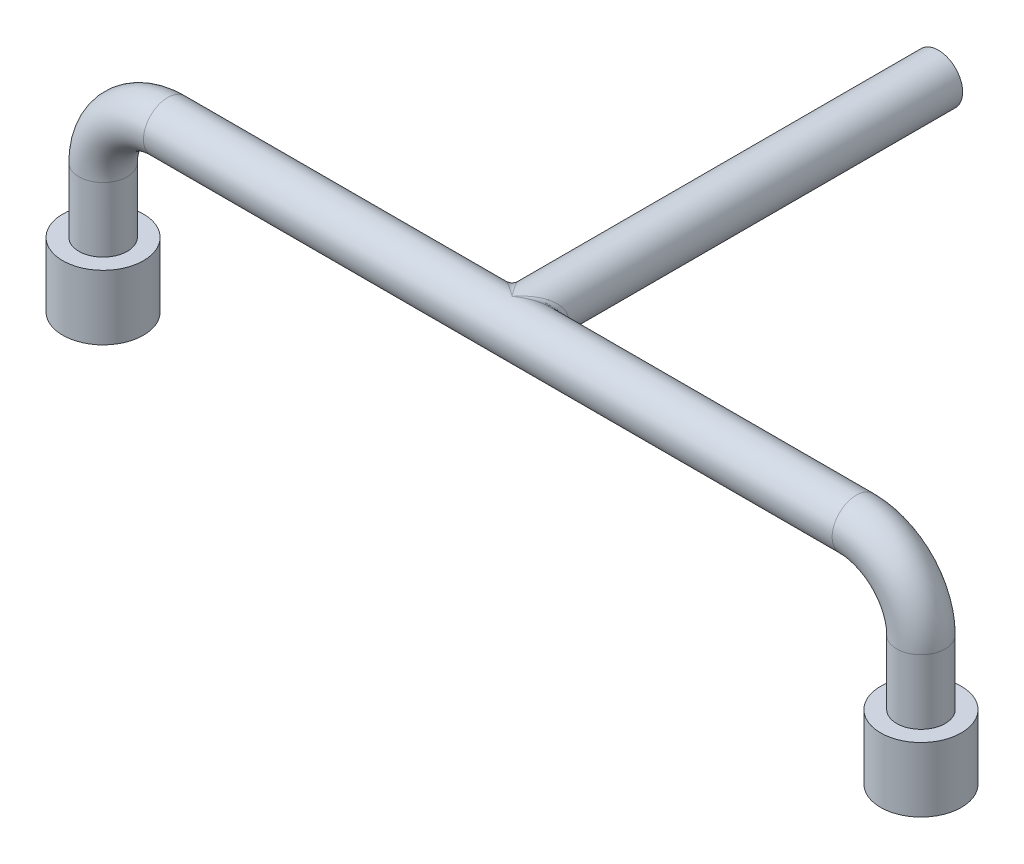
ISO-10303-21;
HEADER;
FILE_DESCRIPTION(('STEP AP214'),'2;1');
FILE_NAME('part.step','',(''),(''),'','','');
FILE_SCHEMA(('AUTOMOTIVE_DESIGN { 1 0 10303 214 1 1 1 1 }'));
ENDSEC;
DATA;
#1=APPLICATION_CONTEXT('core data for automotive mechanical design processes');
#2=APPLICATION_PROTOCOL_DEFINITION('international standard','automotive_design',2000,#1);
#3=PRODUCT_CONTEXT('',#1,'mechanical');
#4=PRODUCT('Part','Part','',(#3));
#5=PRODUCT_RELATED_PRODUCT_CATEGORY('part','',(#4));
#6=PRODUCT_DEFINITION_FORMATION('','',#4);
#7=PRODUCT_DEFINITION_CONTEXT('part definition',#1,'design');
#8=PRODUCT_DEFINITION('design','',#6,#7);
#9=PRODUCT_DEFINITION_SHAPE('','',#8);
#10=(LENGTH_UNIT() NAMED_UNIT(*) SI_UNIT(.MILLI.,.METRE.));
#11=(NAMED_UNIT(*) PLANE_ANGLE_UNIT() SI_UNIT($,.RADIAN.));
#12=(NAMED_UNIT(*) SI_UNIT($,.STERADIAN.) SOLID_ANGLE_UNIT());
#13=UNCERTAINTY_MEASURE_WITH_UNIT(LENGTH_MEASURE(1.E-05),#10,'distance_accuracy_value','');
#14=(GEOMETRIC_REPRESENTATION_CONTEXT(3) GLOBAL_UNCERTAINTY_ASSIGNED_CONTEXT((#13)) GLOBAL_UNIT_ASSIGNED_CONTEXT((#10,
#11,#12)) REPRESENTATION_CONTEXT('',''));
#15=CARTESIAN_POINT('',(0.,0.,0.));
#16=DIRECTION('',(0.,0.,1.));
#17=DIRECTION('',(1.,0.,0.));
#18=AXIS2_PLACEMENT_3D('',#15,#16,#17);
#19=CARTESIAN_POINT('',(80.391,12.7,0.));
#20=DIRECTION('',(0.,-1.,0.));
#21=DIRECTION('',(0.,0.,-1.));
#22=AXIS2_PLACEMENT_3D('',#19,#20,#21);
#23=CYLINDRICAL_SURFACE('',#22,4.7625);
#24=CARTESIAN_POINT('',(80.391,12.7,0.));
#25=DIRECTION('',(0.,-1.,0.));
#26=DIRECTION('',(0.,0.,1.));
#27=AXIS2_PLACEMENT_3D('',#24,#25,#26);
#28=CIRCLE('',#27,4.7625);
#29=CARTESIAN_POINT('',(85.1535,12.7,0.));
#30=VERTEX_POINT('',#29);
#31=EDGE_CURVE('E83',#30,#30,#28,.T.);
#32=ORIENTED_EDGE('',*,*,#31,.T.);
#33=EDGE_LOOP('',(#32));
#34=FACE_BOUND('',#33,.T.);
#35=CARTESIAN_POINT('',(80.391,0.,0.));
#36=DIRECTION('',(0.,-1.,0.));
#37=DIRECTION('',(0.,0.,1.));
#38=AXIS2_PLACEMENT_3D('',#35,#36,#37);
#39=CIRCLE('',#38,4.7625);
#40=CARTESIAN_POINT('',(80.391,0.,4.7625));
#41=VERTEX_POINT('',#40);
#42=EDGE_CURVE('E80',#41,#41,#39,.T.);
#43=ORIENTED_EDGE('',*,*,#42,.F.);
#44=EDGE_LOOP('',(#43));
#45=FACE_BOUND('',#44,.T.);
#46=ADVANCED_FACE('F45',(#34,#45),#23,.T.);
#47=CARTESIAN_POINT('',(67.691,12.7,0.));
#48=DIRECTION('',(0.,0.,-1.));
#49=DIRECTION('',(-1.,0.,0.));
#50=AXIS2_PLACEMENT_3D('',#47,#48,#49);
#51=TOROIDAL_SURFACE('',#50,12.7,4.7625);
#52=CARTESIAN_POINT('',(67.691,25.4,0.));
#53=DIRECTION('',(1.,0.,0.));
#54=DIRECTION('',(0.,0.,1.));
#55=AXIS2_PLACEMENT_3D('',#52,#53,#54);
#56=CIRCLE('',#55,4.7625);
#57=CARTESIAN_POINT('',(67.691,30.1625,0.));
#58=VERTEX_POINT('',#57);
#59=EDGE_CURVE('E113',#58,#58,#56,.T.);
#60=CARTESIAN_POINT('',(67.691,12.7,0.));
#61=DIRECTION('',(0.,0.,-1.));
#62=DIRECTION('',(-1.,0.,0.));
#63=AXIS2_PLACEMENT_3D('',#60,#61,#62);
#64=CIRCLE('',#63,17.4625);
#65=EDGE_CURVE('',#58,#30,#64,.T.);
#66=ORIENTED_EDGE('',*,*,#59,.T.);
#67=ORIENTED_EDGE('',*,*,#31,.F.);
#68=ORIENTED_EDGE('',*,*,#65,.T.);
#69=ORIENTED_EDGE('',*,*,#65,.F.);
#70=EDGE_LOOP('',(#66,#68,#67,#69));
#71=FACE_BOUND('',#70,.T.);
#72=ADVANCED_FACE('F100',(#71),#51,.T.);
#73=CARTESIAN_POINT('',(-67.691,25.4,0.));
#74=DIRECTION('',(1.,0.,0.));
#75=DIRECTION('',(0.,1.,0.));
#76=AXIS2_PLACEMENT_3D('',#73,#74,#75);
#77=CYLINDRICAL_SURFACE('',#76,4.7625);
#78=CARTESIAN_POINT('',(0.,25.4,0.));
#79=DIRECTION('',(-0.6,0.,-0.8));
#80=DIRECTION('',(-0.8,0.,0.6));
#81=AXIS2_PLACEMENT_3D('',#78,#79,#80);
#82=ELLIPSE('',#81,7.93749999999999,4.76249999999999);
#83=CARTESIAN_POINT('',(0.,20.6375,0.));
#84=VERTEX_POINT('',#83);
#85=CARTESIAN_POINT('',(0.,30.1625,0.));
#86=VERTEX_POINT('',#85);
#87=EDGE_CURVE('E58',#84,#86,#82,.F.);
#88=ORIENTED_EDGE('',*,*,#87,.T.);
#89=CARTESIAN_POINT('',(0.,25.4,0.));
#90=DIRECTION('',(0.6,0.,-0.8));
#91=DIRECTION('',(0.8,0.,0.6));
#92=AXIS2_PLACEMENT_3D('',#89,#90,#91);
#93=ELLIPSE('',#92,7.93749999999999,4.76249999999999);
#94=EDGE_CURVE('E11',#86,#84,#93,.F.);
#95=ORIENTED_EDGE('',*,*,#94,.T.);
#96=EDGE_LOOP('',(#88,#95));
#97=FACE_BOUND('',#96,.T.);
#98=CARTESIAN_POINT('',(-67.691,25.4,0.));
#99=DIRECTION('',(1.,0.,0.));
#100=DIRECTION('',(0.,0.,1.));
#101=AXIS2_PLACEMENT_3D('',#98,#99,#100);
#102=CIRCLE('',#101,4.7625);
#103=CARTESIAN_POINT('',(-67.691,30.1625,0.));
#104=VERTEX_POINT('',#103);
#105=EDGE_CURVE('E116',#104,#104,#102,.T.);
#106=ORIENTED_EDGE('',*,*,#105,.T.);
#107=EDGE_LOOP('',(#106));
#108=FACE_BOUND('',#107,.T.);
#109=ORIENTED_EDGE('',*,*,#59,.F.);
#110=EDGE_LOOP('',(#109));
#111=FACE_BOUND('',#110,.T.);
#112=ADVANCED_FACE('F73',(#97,#108,#111),#77,.T.);
#113=CARTESIAN_POINT('',(-67.691,12.7,0.));
#114=DIRECTION('',(0.,0.,-1.));
#115=DIRECTION('',(-1.,0.,0.));
#116=AXIS2_PLACEMENT_3D('',#113,#114,#115);
#117=TOROIDAL_SURFACE('',#116,12.7,4.7625);
#118=CARTESIAN_POINT('',(-80.391,12.7,0.));
#119=DIRECTION('',(0.,1.,0.));
#120=DIRECTION('',(0.,0.,1.));
#121=AXIS2_PLACEMENT_3D('',#118,#119,#120);
#122=CIRCLE('',#121,4.7625);
#123=CARTESIAN_POINT('',(-85.1535,12.7,0.));
#124=VERTEX_POINT('',#123);
#125=EDGE_CURVE('E121',#124,#124,#122,.T.);
#126=CARTESIAN_POINT('',(-67.691,12.7,0.));
#127=DIRECTION('',(0.,0.,-1.));
#128=DIRECTION('',(-1.,0.,0.));
#129=AXIS2_PLACEMENT_3D('',#126,#127,#128);
#130=CIRCLE('',#129,17.4625);
#131=EDGE_CURVE('',#124,#104,#130,.T.);
#132=ORIENTED_EDGE('',*,*,#125,.T.);
#133=ORIENTED_EDGE('',*,*,#105,.F.);
#134=ORIENTED_EDGE('',*,*,#131,.T.);
#135=ORIENTED_EDGE('',*,*,#131,.F.);
#136=EDGE_LOOP('',(#132,#134,#133,#135));
#137=FACE_BOUND('',#136,.T.);
#138=ADVANCED_FACE('F99',(#137),#117,.T.);
#139=CARTESIAN_POINT('',(-80.391,12.7,0.));
#140=DIRECTION('',(0.,-1.,0.));
#141=DIRECTION('',(0.,0.,-1.));
#142=AXIS2_PLACEMENT_3D('',#139,#140,#141);
#143=CYLINDRICAL_SURFACE('',#142,4.7625);
#144=ORIENTED_EDGE('',*,*,#125,.F.);
#145=EDGE_LOOP('',(#144));
#146=FACE_BOUND('',#145,.T.);
#147=CARTESIAN_POINT('',(-80.391,0.,0.));
#148=DIRECTION('',(0.,-1.,0.));
#149=DIRECTION('',(0.,0.,-1.));
#150=AXIS2_PLACEMENT_3D('',#147,#148,#149);
#151=CIRCLE('',#150,4.7625);
#152=CARTESIAN_POINT('',(-80.391,0.,-4.7625));
#153=VERTEX_POINT('',#152);
#154=EDGE_CURVE('E124',#153,#153,#151,.T.);
#155=ORIENTED_EDGE('',*,*,#154,.F.);
#156=EDGE_LOOP('',(#155));
#157=FACE_BOUND('',#156,.T.);
#158=ADVANCED_FACE('F173',(#146,#157),#143,.T.);
#159=CARTESIAN_POINT('',(-80.391,0.,0.));
#160=DIRECTION('',(0.,-1.,0.));
#161=DIRECTION('',(0.,0.,-1.));
#162=AXIS2_PLACEMENT_3D('',#159,#160,#161);
#163=PLANE('',#162);
#164=CARTESIAN_POINT('',(-80.391,0.,0.));
#165=DIRECTION('',(0.,-1.,0.));
#166=DIRECTION('',(0.,0.,-1.));
#167=AXIS2_PLACEMENT_3D('',#164,#165,#166);
#168=CIRCLE('',#167,7.93749999999999);
#169=CARTESIAN_POINT('',(-80.391,0.,-7.93749999999999));
#170=VERTEX_POINT('',#169);
#171=EDGE_CURVE('E128',#170,#170,#168,.T.);
#172=ORIENTED_EDGE('',*,*,#171,.F.);
#173=EDGE_LOOP('',(#172));
#174=FACE_BOUND('',#173,.T.);
#175=ORIENTED_EDGE('',*,*,#154,.T.);
#176=EDGE_LOOP('',(#175));
#177=FACE_BOUND('',#176,.T.);
#178=ADVANCED_FACE('F170',(#174,#177),#163,.F.);
#179=CARTESIAN_POINT('',(-80.391,-12.7,0.));
#180=DIRECTION('',(0.,1.,0.));
#181=DIRECTION('',(0.,0.,1.));
#182=AXIS2_PLACEMENT_3D('',#179,#180,#181);
#183=CYLINDRICAL_SURFACE('',#182,7.93749999999999);
#184=CARTESIAN_POINT('',(-80.391,-12.7,0.));
#185=DIRECTION('',(0.,-1.,0.));
#186=DIRECTION('',(0.,0.,-1.));
#187=AXIS2_PLACEMENT_3D('',#184,#185,#186);
#188=CIRCLE('',#187,7.93749999999999);
#189=CARTESIAN_POINT('',(-80.391,-12.7,-7.93749999999999));
#190=VERTEX_POINT('',#189);
#191=EDGE_CURVE('E127',#190,#190,#188,.T.);
#192=ORIENTED_EDGE('',*,*,#191,.F.);
#193=EDGE_LOOP('',(#192));
#194=FACE_BOUND('',#193,.T.);
#195=ORIENTED_EDGE('',*,*,#171,.T.);
#196=EDGE_LOOP('',(#195));
#197=FACE_BOUND('',#196,.T.);
#198=ADVANCED_FACE('F168',(#194,#197),#183,.T.);
#199=CARTESIAN_POINT('',(-80.391,-12.7,0.));
#200=DIRECTION('',(0.,-1.,0.));
#201=DIRECTION('',(0.,0.,-1.));
#202=AXIS2_PLACEMENT_3D('',#199,#200,#201);
#203=PLANE('',#202);
#204=ORIENTED_EDGE('',*,*,#191,.T.);
#205=EDGE_LOOP('',(#204));
#206=FACE_BOUND('',#205,.T.);
#207=ADVANCED_FACE('F164',(#206),#203,.T.);
#208=CARTESIAN_POINT('',(80.391,-12.6999999999387,0.));
#209=DIRECTION('',(0.,1.,0.));
#210=DIRECTION('',(-1.,0.,0.));
#211=AXIS2_PLACEMENT_3D('',#208,#209,#210);
#212=CYLINDRICAL_SURFACE('',#211,7.93750000000001);
#213=CARTESIAN_POINT('',(80.391,-12.6999999999387,0.));
#214=DIRECTION('',(0.,-1.,0.));
#215=DIRECTION('',(1.,0.,0.));
#216=AXIS2_PLACEMENT_3D('',#213,#214,#215);
#217=CIRCLE('',#216,7.93750000000001);
#218=CARTESIAN_POINT('',(88.3285,-12.6999999999387,0.));
#219=VERTEX_POINT('',#218);
#220=EDGE_CURVE('E131',#219,#219,#217,.T.);
#221=ORIENTED_EDGE('',*,*,#220,.F.);
#222=EDGE_LOOP('',(#221));
#223=FACE_BOUND('',#222,.T.);
#224=CARTESIAN_POINT('',(80.391,6.12637972810166E-11,0.));
#225=DIRECTION('',(0.,-1.,0.));
#226=DIRECTION('',(1.,0.,0.));
#227=AXIS2_PLACEMENT_3D('',#224,#225,#226);
#228=CIRCLE('',#227,7.93750000000001);
#229=CARTESIAN_POINT('',(88.3285,6.12647693123099E-11,0.));
#230=VERTEX_POINT('',#229);
#231=EDGE_CURVE('E134',#230,#230,#228,.T.);
#232=ORIENTED_EDGE('',*,*,#231,.T.);
#233=EDGE_LOOP('',(#232));
#234=FACE_BOUND('',#233,.T.);
#235=ADVANCED_FACE('F158',(#223,#234),#212,.T.);
#236=CARTESIAN_POINT('',(80.391,-12.6999999999387,0.));
#237=DIRECTION('',(0.,-1.,0.));
#238=DIRECTION('',(1.,0.,0.));
#239=AXIS2_PLACEMENT_3D('',#236,#237,#238);
#240=PLANE('',#239);
#241=ORIENTED_EDGE('',*,*,#220,.T.);
#242=EDGE_LOOP('',(#241));
#243=FACE_BOUND('',#242,.T.);
#244=ADVANCED_FACE('F152',(#243),#240,.T.);
#245=CARTESIAN_POINT('',(80.391,6.12637972810166E-11,0.));
#246=DIRECTION('',(0.,-1.,0.));
#247=DIRECTION('',(1.,0.,0.));
#248=AXIS2_PLACEMENT_3D('',#245,#246,#247);
#249=PLANE('',#248);
#250=ORIENTED_EDGE('',*,*,#42,.T.);
#251=EDGE_LOOP('',(#250));
#252=FACE_BOUND('',#251,.T.);
#253=ORIENTED_EDGE('',*,*,#231,.F.);
#254=EDGE_LOOP('',(#253));
#255=FACE_BOUND('',#254,.T.);
#256=ADVANCED_FACE('F149',(#252,#255),#249,.F.);
#257=CARTESIAN_POINT('',(0.,25.4,-83.82));
#258=DIRECTION('',(0.,0.,1.));
#259=DIRECTION('',(1.,0.,0.));
#260=AXIS2_PLACEMENT_3D('',#257,#258,#259);
#261=CYLINDRICAL_SURFACE('',#260,4.76249999999999);
#262=CARTESIAN_POINT('',(0.,25.4,-83.82));
#263=DIRECTION('',(0.,0.,1.));
#264=DIRECTION('',(1.,0.,0.));
#265=AXIS2_PLACEMENT_3D('',#262,#263,#264);
#266=CIRCLE('',#265,4.76249999999999);
#267=CARTESIAN_POINT('',(4.76249999999999,25.4,-83.82));
#268=VERTEX_POINT('',#267);
#269=EDGE_CURVE('E137',#268,#268,#266,.T.);
#270=ORIENTED_EDGE('',*,*,#269,.T.);
#271=EDGE_LOOP('',(#270));
#272=FACE_BOUND('',#271,.T.);
#273=CARTESIAN_POINT('',(0.,25.4,0.));
#274=DIRECTION('',(-0.8,0.,-0.599999999999999));
#275=DIRECTION('',(-0.6,0.,0.8));
#276=AXIS2_PLACEMENT_3D('',#273,#274,#275);
#277=ELLIPSE('',#276,7.93749999999999,4.76249999999999);
#278=EDGE_CURVE('E78',#86,#84,#277,.T.);
#279=ORIENTED_EDGE('',*,*,#278,.T.);
#280=CARTESIAN_POINT('',(0.,25.4,0.));
#281=DIRECTION('',(0.8,0.,-0.599999999999999));
#282=DIRECTION('',(0.6,0.,0.8));
#283=AXIS2_PLACEMENT_3D('',#280,#281,#282);
#284=ELLIPSE('',#283,7.93749999999999,4.76249999999999);
#285=EDGE_CURVE('E70',#84,#86,#284,.T.);
#286=ORIENTED_EDGE('',*,*,#285,.T.);
#287=EDGE_LOOP('',(#279,#286));
#288=FACE_BOUND('',#287,.T.);
#289=ADVANCED_FACE('F77',(#272,#288),#261,.T.);
#290=CARTESIAN_POINT('',(0.,25.4,-83.82));
#291=DIRECTION('',(0.,0.,1.));
#292=DIRECTION('',(1.,0.,0.));
#293=AXIS2_PLACEMENT_3D('',#290,#291,#292);
#294=PLANE('',#293);
#295=ORIENTED_EDGE('',*,*,#269,.F.);
#296=EDGE_LOOP('',(#295));
#297=FACE_BOUND('',#296,.T.);
#298=ADVANCED_FACE('F91',(#297),#294,.F.);
#299=CARTESIAN_POINT('',(0.,30.1625,0.));
#300=CARTESIAN_POINT('',(0.,30.1625,0.));
#301=CARTESIAN_POINT('',(0.,30.1625,0.));
#302=CARTESIAN_POINT('',(-0.276636144109102,30.1624165246859,-0.207477108081827));
#303=CARTESIAN_POINT('',(-0.242104847775386,30.1628138962065,-0.242104847775386));
#304=CARTESIAN_POINT('',(-0.207477108081826,30.1624165246859,-0.276636144109102));
#305=CARTESIAN_POINT('',(-0.553342922971761,30.1489352393053,-0.415007192228821));
#306=CARTESIAN_POINT('',(-0.484875982339502,30.1444046693051,-0.484875982339502));
#307=CARTESIAN_POINT('',(-0.415007192228821,30.1489352393053,-0.553342922971761));
#308=CARTESIAN_POINT('',(-1.10199801149477,30.0948080845946,-0.826498508621077));
#309=CARTESIAN_POINT('',(-0.963135467760903,30.0721650554374,-0.963135467760904));
#310=CARTESIAN_POINT('',(-0.826498508621076,30.0948080845945,-1.10199801149477));
#311=CARTESIAN_POINT('',(-1.3739667760727,30.0543940853024,-1.03047508205453));
#312=CARTESIAN_POINT('',(-1.19999714632442,30.0182310228095,-1.19999714632442));
#313=CARTESIAN_POINT('',(-1.03047508205452,30.0543940853024,-1.3739667760727));
#314=CARTESIAN_POINT('',(-1.90851421254349,29.9469580402503,-1.43138565940762));
#315=CARTESIAN_POINT('',(-1.66059092050676,29.876334492538,-1.66059092050676));
#316=CARTESIAN_POINT('',(-1.43138565940762,29.9469580402503,-1.90851421254349));
#317=CARTESIAN_POINT('',(-2.17117387051649,29.8803936597922,-1.62838040288737));
#318=CARTESIAN_POINT('',(-1.88567913936315,29.7881682137678,-1.88567913936315));
#319=CARTESIAN_POINT('',(-1.62838040288737,29.8803936597922,-2.17117387051649));
#320=CARTESIAN_POINT('',(-2.68252871536545,29.7215399209432,-2.01189653652408));
#321=CARTESIAN_POINT('',(-2.31709780368268,29.5808891428275,-2.31709780368268));
#322=CARTESIAN_POINT('',(-2.01189653652408,29.7215399209432,-2.68252871536545));
#323=CARTESIAN_POINT('',(-2.93140851262626,29.629924676609,-2.19855638446969));
#324=CARTESIAN_POINT('',(-2.52473958108579,29.4614763748376,-2.52473958108579));
#325=CARTESIAN_POINT('',(-2.19855638446969,29.6299246766089,-2.93140851262626));
#326=CARTESIAN_POINT('',(-3.41083795440868,29.4223246880695,-2.55812846580651));
#327=CARTESIAN_POINT('',(-2.91600898929598,29.1960416589958,-2.91600898929598));
#328=CARTESIAN_POINT('',(-2.55812846580651,29.4223246880695,-3.41083795440868));
#329=CARTESIAN_POINT('',(-3.64171889556167,29.3072084469033,-2.73128917167126));
#330=CARTESIAN_POINT('',(-3.1008675301886,29.0496426920417,-3.1008675301886));
#331=CARTESIAN_POINT('',(-2.73128917167125,29.3072084469033,-3.64171889556167));
#332=CARTESIAN_POINT('',(-4.08104388669873,29.0543780859064,-3.06078291502405));
#333=CARTESIAN_POINT('',(-3.44199674373743,28.7361739863697,-3.44199674373743));
#334=CARTESIAN_POINT('',(-3.06078291502404,29.0543780859064,-4.08104388669873));
#335=CARTESIAN_POINT('',(-4.29000711482278,28.9176887105228,-3.21750533611709));
#336=CARTESIAN_POINT('',(-3.59936672350584,28.5686920739252,-3.59936672350584));
#337=CARTESIAN_POINT('',(-3.21750533611708,28.9176887105228,-4.29000711482278));
#338=CARTESIAN_POINT('',(-4.68172342974915,28.6238976459748,-3.51129257231186));
#339=CARTESIAN_POINT('',(-3.8821353406164,28.2206619503325,-3.8821353406164));
#340=CARTESIAN_POINT('',(-3.51129257231186,28.6238976459748,-4.68172342974915));
#341=CARTESIAN_POINT('',(-4.86521386828273,28.4679136477452,-3.64891040121205));
#342=CARTESIAN_POINT('',(-4.00844160972768,28.039744468855,-4.00844160972768));
#343=CARTESIAN_POINT('',(-3.64891040121205,28.4679136477452,-4.86521386828273));
#344=CARTESIAN_POINT('',(-5.20261642565318,28.1381211310113,-3.90196231923989));
#345=CARTESIAN_POINT('',(-4.22765661795512,27.6738976759814,-4.22765661795512));
#346=CARTESIAN_POINT('',(-3.90196231923988,28.1381211310113,-5.20261642565318));
#347=CARTESIAN_POINT('',(-5.35748732158705,27.9654289287181,-4.01811549119029));
#348=CARTESIAN_POINT('',(-4.32122640331491,27.488762399381,-4.32122640331491));
#349=CARTESIAN_POINT('',(-4.01811549119029,27.9654289287181,-5.35748732158705));
#350=CARTESIAN_POINT('',(-5.63477398209998,27.6052051725787,-4.22608048657499));
#351=CARTESIAN_POINT('',(-4.47643359152566,27.1239596449436,-4.47643359152566));
#352=CARTESIAN_POINT('',(-4.22608048657499,27.6052051725787,-5.63477398209998));
#353=CARTESIAN_POINT('',(-5.75832102813724,27.4186658166692,-4.31874077110293));
#354=CARTESIAN_POINT('',(-4.53846005821155,26.9444006382712,-4.53846005821155));
#355=CARTESIAN_POINT('',(-4.31874077110292,27.4186658166692,-5.75832102813724));
#356=CARTESIAN_POINT('',(-5.9706844248482,27.0341162705327,-4.47801331863615));
#357=CARTESIAN_POINT('',(-4.63555117722643,26.5983399156441,-4.63555117722643));
#358=CARTESIAN_POINT('',(-4.47801331863614,27.0341162705327,-5.9706844248482));
#359=CARTESIAN_POINT('',(-6.06067669184656,26.8368468919352,-4.54550751888492));
#360=CARTESIAN_POINT('',(-4.6707623658728,26.4323987364077,-4.6707623658728));
#361=CARTESIAN_POINT('',(-4.54550751888492,26.8368468919352,-6.06067669184656));
#362=CARTESIAN_POINT('',(-6.20439080078656,26.4345365569956,-4.65329310058992));
#363=CARTESIAN_POINT('',(-4.72196488162732,26.1158674475182,-4.72196488162732));
#364=CARTESIAN_POINT('',(-4.65329310058992,26.4345365569956,-6.20439080078656));
#365=CARTESIAN_POINT('',(-6.25912057996809,26.2299068098607,-4.69434043497607));
#366=CARTESIAN_POINT('',(-4.7379497748783,25.9663400491661,-4.7379497748783));
#367=CARTESIAN_POINT('',(-4.69434043497606,26.2299068098607,-6.25912057996809));
#368=CARTESIAN_POINT('',(-6.3316294277291,25.8167722698911,-4.74872207079683));
#369=CARTESIAN_POINT('',(-4.75823917623773,25.6771687936645,-4.75823917623773));
#370=CARTESIAN_POINT('',(-4.74872207079682,25.8167722698911,-6.3316294277291));
#371=CARTESIAN_POINT('',(-6.34999999999999,25.6083861349455,-4.7625));
#372=CARTESIAN_POINT('',(-4.76249999999999,25.5389887993662,-4.76249999999999));
#373=CARTESIAN_POINT('',(-4.76249999999999,25.6083861349455,-6.34999999999999));
#374=CARTESIAN_POINT('',(-6.34999999999999,25.1916138650545,-4.7625));
#375=CARTESIAN_POINT('',(-4.76249999999999,25.2610112006338,-4.76249999999999));
#376=CARTESIAN_POINT('',(-4.76249999999999,25.1916138650545,-6.34999999999999));
#377=CARTESIAN_POINT('',(-6.3316294277291,24.9832277301089,-4.74872207079683));
#378=CARTESIAN_POINT('',(-4.75823917623773,25.1228312063355,-4.75823917623773));
#379=CARTESIAN_POINT('',(-4.74872207079682,24.9832277301089,-6.3316294277291));
#380=CARTESIAN_POINT('',(-6.25912057996809,24.5700931901393,-4.69434043497607));
#381=CARTESIAN_POINT('',(-4.7379497748783,24.8336599508338,-4.7379497748783));
#382=CARTESIAN_POINT('',(-4.69434043497606,24.5700931901393,-6.25912057996809));
#383=CARTESIAN_POINT('',(-6.20439080078656,24.3654634430044,-4.65329310058993));
#384=CARTESIAN_POINT('',(-4.72196488162732,24.6841325524818,-4.72196488162732));
#385=CARTESIAN_POINT('',(-4.65329310058992,24.3654634430044,-6.20439080078656));
#386=CARTESIAN_POINT('',(-6.06067669184656,23.9631531080648,-4.54550751888493));
#387=CARTESIAN_POINT('',(-4.6707623658728,24.3676012635923,-4.6707623658728));
#388=CARTESIAN_POINT('',(-4.54550751888492,23.9631531080648,-6.06067669184656));
#389=CARTESIAN_POINT('',(-5.9706844248482,23.7658837294673,-4.47801331863615));
#390=CARTESIAN_POINT('',(-4.63555117722643,24.2016600843559,-4.63555117722643));
#391=CARTESIAN_POINT('',(-4.47801331863614,23.7658837294673,-5.9706844248482));
#392=CARTESIAN_POINT('',(-5.75832102813724,23.3813341833308,-4.31874077110293));
#393=CARTESIAN_POINT('',(-4.53846005821155,23.8555993617288,-4.53846005821155));
#394=CARTESIAN_POINT('',(-4.31874077110292,23.3813341833308,-5.75832102813724));
#395=CARTESIAN_POINT('',(-5.63477398209999,23.1947948274213,-4.22608048657499));
#396=CARTESIAN_POINT('',(-4.47643359152566,23.6760403550564,-4.47643359152566));
#397=CARTESIAN_POINT('',(-4.22608048657498,23.1947948274213,-5.63477398209999));
#398=CARTESIAN_POINT('',(-5.35748732158706,22.8345710712819,-4.0181154911903));
#399=CARTESIAN_POINT('',(-4.32122640331491,23.311237600619,-4.32122640331491));
#400=CARTESIAN_POINT('',(-4.01811549119029,22.8345710712819,-5.35748732158706));
#401=CARTESIAN_POINT('',(-5.20261642565318,22.6618788689887,-3.90196231923989));
#402=CARTESIAN_POINT('',(-4.22765661795512,23.1261023240186,-4.22765661795512));
#403=CARTESIAN_POINT('',(-3.90196231923988,22.6618788689887,-5.20261642565318));
#404=CARTESIAN_POINT('',(-4.86521386828273,22.3320863522548,-3.64891040121205));
#405=CARTESIAN_POINT('',(-4.00844160972768,22.760255531145,-4.00844160972768));
#406=CARTESIAN_POINT('',(-3.64891040121205,22.3320863522548,-4.86521386828273));
#407=CARTESIAN_POINT('',(-4.68172342974915,22.1761023540251,-3.51129257231187));
#408=CARTESIAN_POINT('',(-3.88213534061641,22.5793380496675,-3.88213534061641));
#409=CARTESIAN_POINT('',(-3.51129257231186,22.1761023540252,-4.68172342974915));
#410=CARTESIAN_POINT('',(-4.29000711482278,21.8823112894772,-3.21750533611709));
#411=CARTESIAN_POINT('',(-3.59936672350584,22.2313079260748,-3.59936672350584));
#412=CARTESIAN_POINT('',(-3.21750533611708,21.8823112894772,-4.29000711482278));
#413=CARTESIAN_POINT('',(-4.08104388669873,21.7456219140936,-3.06078291502405));
#414=CARTESIAN_POINT('',(-3.44199674373743,22.0638260136303,-3.44199674373743));
#415=CARTESIAN_POINT('',(-3.06078291502404,21.7456219140936,-4.08104388669873));
#416=CARTESIAN_POINT('',(-3.64171889556168,21.4927915530967,-2.73128917167126));
#417=CARTESIAN_POINT('',(-3.1008675301886,21.7503573079583,-3.1008675301886));
#418=CARTESIAN_POINT('',(-2.73128917167125,21.4927915530967,-3.64171889556168));
#419=CARTESIAN_POINT('',(-3.41083795440868,21.3776753119305,-2.55812846580651));
#420=CARTESIAN_POINT('',(-2.91600898929599,21.6039583410041,-2.91600898929599));
#421=CARTESIAN_POINT('',(-2.55812846580651,21.3776753119305,-3.41083795440868));
#422=CARTESIAN_POINT('',(-2.93140851262626,21.170075323391,-2.1985563844697));
#423=CARTESIAN_POINT('',(-2.52473958108579,21.3385236251623,-2.52473958108579));
#424=CARTESIAN_POINT('',(-2.19855638446969,21.170075323391,-2.93140851262626));
#425=CARTESIAN_POINT('',(-2.68252871536545,21.0784600790568,-2.01189653652409));
#426=CARTESIAN_POINT('',(-2.31709780368268,21.2191108571725,-2.31709780368268));
#427=CARTESIAN_POINT('',(-2.01189653652408,21.0784600790568,-2.68252871536545));
#428=CARTESIAN_POINT('',(-2.17117387051649,20.9196063402078,-1.62838040288737));
#429=CARTESIAN_POINT('',(-1.88567913936315,21.0118317862322,-1.88567913936315));
#430=CARTESIAN_POINT('',(-1.62838040288737,20.9196063402078,-2.17117387051649));
#431=CARTESIAN_POINT('',(-1.90851421254349,20.8530419597497,-1.43138565940762));
#432=CARTESIAN_POINT('',(-1.66059092050676,20.923665507462,-1.66059092050676));
#433=CARTESIAN_POINT('',(-1.43138565940762,20.8530419597497,-1.90851421254349));
#434=CARTESIAN_POINT('',(-1.3739667760727,20.7456059146975,-1.03047508205453));
#435=CARTESIAN_POINT('',(-1.19999714632442,20.7817689771905,-1.19999714632442));
#436=CARTESIAN_POINT('',(-1.03047508205452,20.7456059146976,-1.3739667760727));
#437=CARTESIAN_POINT('',(-1.10199801149477,20.7051919154054,-0.826498508621078));
#438=CARTESIAN_POINT('',(-0.963135467760904,20.7278349445626,-0.963135467760904));
#439=CARTESIAN_POINT('',(-0.826498508621075,20.7051919154054,-1.10199801149477));
#440=CARTESIAN_POINT('',(-0.553342922971762,20.6510647606947,-0.415007192228821));
#441=CARTESIAN_POINT('',(-0.484875982339503,20.6555953306948,-0.484875982339503));
#442=CARTESIAN_POINT('',(-0.415007192228821,20.6510647606947,-0.553342922971762));
#443=CARTESIAN_POINT('',(-0.276636144109103,20.6375834753141,-0.207477108081827));
#444=CARTESIAN_POINT('',(-0.242104847775386,20.6371861037935,-0.242104847775387));
#445=CARTESIAN_POINT('',(-0.207477108081827,20.6375834753141,-0.276636144109103));
#446=CARTESIAN_POINT('',(0.,20.6375,0.));
#447=CARTESIAN_POINT('',(0.,20.6375,0.));
#448=CARTESIAN_POINT('',(0.,20.6375,0.));
#449=(BOUNDED_SURFACE() B_SPLINE_SURFACE(3,2,((#299,#300,#301),(#302,#303,#304),(#305,#306,
#307),(#308,#309,#310),(#311,#312,#313),(#314,#315,#316),(#317,#318,#319),(#320,#321,#322),
(#323,#324,#325),(#326,#327,#328),(#329,#330,#331),(#332,#333,#334),(#335,#336,#337),(#338,#339,
#340),(#341,#342,#343),(#344,#345,#346),(#347,#348,#349),(#350,#351,#352),(#353,#354,#355),
(#356,#357,#358),(#359,#360,#361),(#362,#363,#364),(#365,#366,#367),(#368,#369,#370),(#371,#372,
#373),(#374,#375,#376),(#377,#378,#379),(#380,#381,#382),(#383,#384,#385),(#386,#387,#388),
(#389,#390,#391),(#392,#393,#394),(#395,#396,#397),(#398,#399,#400),(#401,#402,#403),(#404,#405,
#406),(#407,#408,#409),(#410,#411,#412),(#413,#414,#415),(#416,#417,#418),(#419,#420,#421),
(#422,#423,#424),(#425,#426,#427),(#428,#429,#430),(#431,#432,#433),(#434,#435,#436),(#437,#438,
#439),(#440,#441,#442),(#443,#444,#445),(#446,#447,#448)),.UNSPECIFIED.,.F.,.F.,
.F.) B_SPLINE_SURFACE_WITH_KNOTS((4,2,2,2,2,2,2,2,2,2,2,2,2,2,2,2,2,2,2,2,2,2,2,2,4),(3,3),(0.,
1.17341684376805,2.33685977065809,3.48078832236515,4.59653688757617,5.67677110302749,
6.71596340692673,7.71088391583372,8.66108468582681,9.56932066989523,10.4417969917038,
11.2880759169977,12.1204702792375,12.9528646414773,13.7991435667713,14.6716198885798,
15.5798558726482,16.5300566426413,17.5249771515483,18.5641694554476,19.6444036708989,
20.7601522361099,21.904080787817,23.067523714707,24.2409405584751),(0.,1.),
.UNSPECIFIED.) GEOMETRIC_REPRESENTATION_ITEM() RATIONAL_B_SPLINE_SURFACE(((1.,1.,1.),(1.,
1.00000566557019,1.),(1.,0.998576699090688,1.),(1.,0.992910721279765,1.),(1.,0.988697681267574,
1.),(1.,0.97761712883305,1.),(1.,0.970795325018433,1.),(1.,0.954789124900482,1.),(1.,
0.945667069465631,1.),(1.,0.92548796875733,1.),(1.,0.914501756375306,1.),(1.,0.891169998194024,
1.),(1.,0.878891956959708,1.),(1.,0.853706993048538,1.),(1.,0.84084914596985,1.),(1.,
0.815387454422431,1.),(1.,0.802798170091792,1.),(1.,0.778880732263429,1.),(1.,0.767521437046521,
1.),(1.,0.747118526989835,1.),(1.,0.738001346912332,1.),(1.,0.723039691293394,1.),(1.,
0.717105167896984,1.),(1.,0.709170186451793,1.),(1.,0.707106781186548,1.),(1.,0.707106781186548,
1.),(1.,0.709170186451793,1.),(1.,0.717105167896984,1.),(1.,0.723039691293395,1.),(1.,
0.738001346912332,1.),(1.,0.747118526989835,1.),(1.,0.767521437046521,1.),(1.,0.778880732263429,
1.),(1.,0.802798170091792,1.),(1.,0.815387454422431,1.),(1.,0.84084914596985,1.),(1.,
0.853706993048538,1.),(1.,0.878891956959708,1.),(1.,0.891169998194024,1.),(1.,0.914501756375306,
1.),(1.,0.925487968757329,1.),(1.,0.945667069465631,1.),(1.,0.954789124900482,1.),(1.,
0.970795325018433,1.),(1.,0.97761712883305,1.),(1.,0.988697681267574,1.),(1.,0.992910721279765,
1.),(1.,0.998576699090688,1.),(1.,1.00000566557019,1.),(1.,1.,1.))) REPRESENTATION_ITEM('') SURFACE());
#450=ORIENTED_EDGE('',*,*,#285,.F.);
#451=ORIENTED_EDGE('',*,*,#94,.F.);
#452=EDGE_LOOP('',(#450,#451));
#453=FACE_BOUND('',#452,.T.);
#454=ADVANCED_FACE('F68',(#453),#449,.F.);
#455=CARTESIAN_POINT('',(0.,20.6375,0.));
#456=CARTESIAN_POINT('',(0.,20.6375,0.));
#457=CARTESIAN_POINT('',(0.,20.6375,0.));
#458=CARTESIAN_POINT('',(0.276636144109102,20.6375834753141,-0.207477108081827));
#459=CARTESIAN_POINT('',(0.242104847775386,20.6371861037935,-0.242104847775386));
#460=CARTESIAN_POINT('',(0.207477108081826,20.6375834753141,-0.276636144109102));
#461=CARTESIAN_POINT('',(0.553342922971761,20.6510647606947,-0.415007192228821));
#462=CARTESIAN_POINT('',(0.484875982339503,20.6555953306948,-0.484875982339503));
#463=CARTESIAN_POINT('',(0.41500719222882,20.6510647606947,-0.553342922971761));
#464=CARTESIAN_POINT('',(1.10199801149477,20.7051919154054,-0.826498508621077));
#465=CARTESIAN_POINT('',(0.963135467760903,20.7278349445626,-0.963135467760903));
#466=CARTESIAN_POINT('',(0.826498508621075,20.7051919154054,-1.10199801149477));
#467=CARTESIAN_POINT('',(1.3739667760727,20.7456059146975,-1.03047508205453));
#468=CARTESIAN_POINT('',(1.19999714632442,20.7817689771905,-1.19999714632442));
#469=CARTESIAN_POINT('',(1.03047508205452,20.7456059146976,-1.3739667760727));
#470=CARTESIAN_POINT('',(1.90851421254349,20.8530419597497,-1.43138565940762));
#471=CARTESIAN_POINT('',(1.66059092050676,20.923665507462,-1.66059092050676));
#472=CARTESIAN_POINT('',(1.43138565940762,20.8530419597497,-1.90851421254349));
#473=CARTESIAN_POINT('',(2.17117387051649,20.9196063402078,-1.62838040288737));
#474=CARTESIAN_POINT('',(1.88567913936315,21.0118317862322,-1.88567913936315));
#475=CARTESIAN_POINT('',(1.62838040288737,20.9196063402078,-2.17117387051649));
#476=CARTESIAN_POINT('',(2.68252871536544,21.0784600790568,-2.01189653652409));
#477=CARTESIAN_POINT('',(2.31709780368268,21.2191108571725,-2.31709780368268));
#478=CARTESIAN_POINT('',(2.01189653652408,21.0784600790568,-2.68252871536544));
#479=CARTESIAN_POINT('',(2.93140851262626,21.170075323391,-2.19855638446969));
#480=CARTESIAN_POINT('',(2.52473958108579,21.3385236251623,-2.52473958108579));
#481=CARTESIAN_POINT('',(2.19855638446969,21.170075323391,-2.93140851262626));
#482=CARTESIAN_POINT('',(3.41083795440868,21.3776753119305,-2.55812846580651));
#483=CARTESIAN_POINT('',(2.91600898929598,21.6039583410041,-2.91600898929598));
#484=CARTESIAN_POINT('',(2.5581284658065,21.3776753119305,-3.41083795440868));
#485=CARTESIAN_POINT('',(3.64171889556167,21.4927915530967,-2.73128917167126));
#486=CARTESIAN_POINT('',(3.1008675301886,21.7503573079583,-3.1008675301886));
#487=CARTESIAN_POINT('',(2.73128917167125,21.4927915530967,-3.64171889556167));
#488=CARTESIAN_POINT('',(4.08104388669873,21.7456219140936,-3.06078291502405));
#489=CARTESIAN_POINT('',(3.44199674373743,22.0638260136303,-3.44199674373743));
#490=CARTESIAN_POINT('',(3.06078291502404,21.7456219140936,-4.08104388669873));
#491=CARTESIAN_POINT('',(4.29000711482278,21.8823112894772,-3.21750533611709));
#492=CARTESIAN_POINT('',(3.59936672350584,22.2313079260748,-3.59936672350584));
#493=CARTESIAN_POINT('',(3.21750533611708,21.8823112894772,-4.29000711482278));
#494=CARTESIAN_POINT('',(4.68172342974915,22.1761023540251,-3.51129257231186));
#495=CARTESIAN_POINT('',(3.8821353406164,22.5793380496675,-3.8821353406164));
#496=CARTESIAN_POINT('',(3.51129257231186,22.1761023540252,-4.68172342974915));
#497=CARTESIAN_POINT('',(4.86521386828273,22.3320863522548,-3.64891040121205));
#498=CARTESIAN_POINT('',(4.00844160972768,22.760255531145,-4.00844160972768));
#499=CARTESIAN_POINT('',(3.64891040121204,22.3320863522548,-4.86521386828273));
#500=CARTESIAN_POINT('',(5.20261642565318,22.6618788689887,-3.90196231923989));
#501=CARTESIAN_POINT('',(4.22765661795512,23.1261023240186,-4.22765661795512));
#502=CARTESIAN_POINT('',(3.90196231923988,22.6618788689887,-5.20261642565318));
#503=CARTESIAN_POINT('',(5.35748732158705,22.8345710712819,-4.0181154911903));
#504=CARTESIAN_POINT('',(4.32122640331491,23.311237600619,-4.32122640331491));
#505=CARTESIAN_POINT('',(4.01811549119029,22.8345710712819,-5.35748732158705));
#506=CARTESIAN_POINT('',(5.63477398209998,23.1947948274213,-4.22608048657499));
#507=CARTESIAN_POINT('',(4.47643359152566,23.6760403550564,-4.47643359152566));
#508=CARTESIAN_POINT('',(4.22608048657498,23.1947948274213,-5.63477398209998));
#509=CARTESIAN_POINT('',(5.75832102813724,23.3813341833308,-4.31874077110293));
#510=CARTESIAN_POINT('',(4.53846005821155,23.8555993617288,-4.53846005821155));
#511=CARTESIAN_POINT('',(4.31874077110292,23.3813341833308,-5.75832102813724));
#512=CARTESIAN_POINT('',(5.9706844248482,23.7658837294673,-4.47801331863615));
#513=CARTESIAN_POINT('',(4.63555117722643,24.2016600843559,-4.63555117722643));
#514=CARTESIAN_POINT('',(4.47801331863614,23.7658837294673,-5.9706844248482));
#515=CARTESIAN_POINT('',(6.06067669184656,23.9631531080648,-4.54550751888493));
#516=CARTESIAN_POINT('',(4.6707623658728,24.3676012635923,-4.6707623658728));
#517=CARTESIAN_POINT('',(4.54550751888492,23.9631531080648,-6.06067669184656));
#518=CARTESIAN_POINT('',(6.20439080078656,24.3654634430044,-4.65329310058993));
#519=CARTESIAN_POINT('',(4.72196488162732,24.6841325524818,-4.72196488162732));
#520=CARTESIAN_POINT('',(4.65329310058992,24.3654634430044,-6.20439080078656));
#521=CARTESIAN_POINT('',(6.25912057996809,24.5700931901393,-4.69434043497607));
#522=CARTESIAN_POINT('',(4.7379497748783,24.8336599508338,-4.7379497748783));
#523=CARTESIAN_POINT('',(4.69434043497606,24.5700931901393,-6.25912057996809));
#524=CARTESIAN_POINT('',(6.3316294277291,24.9832277301089,-4.74872207079683));
#525=CARTESIAN_POINT('',(4.75823917623773,25.1228312063355,-4.75823917623773));
#526=CARTESIAN_POINT('',(4.74872207079682,24.9832277301089,-6.3316294277291));
#527=CARTESIAN_POINT('',(6.34999999999999,25.1916138650545,-4.7625));
#528=CARTESIAN_POINT('',(4.76249999999999,25.2610112006337,-4.76249999999999));
#529=CARTESIAN_POINT('',(4.76249999999999,25.1916138650545,-6.34999999999999));
#530=CARTESIAN_POINT('',(6.34999999999999,25.6083861349455,-4.7625));
#531=CARTESIAN_POINT('',(4.76249999999999,25.5389887993662,-4.76249999999999));
#532=CARTESIAN_POINT('',(4.76249999999999,25.6083861349455,-6.34999999999999));
#533=CARTESIAN_POINT('',(6.3316294277291,25.8167722698911,-4.74872207079683));
#534=CARTESIAN_POINT('',(4.75823917623773,25.6771687936645,-4.75823917623773));
#535=CARTESIAN_POINT('',(4.74872207079682,25.8167722698911,-6.3316294277291));
#536=CARTESIAN_POINT('',(6.25912057996809,26.2299068098607,-4.69434043497607));
#537=CARTESIAN_POINT('',(4.7379497748783,25.9663400491661,-4.7379497748783));
#538=CARTESIAN_POINT('',(4.69434043497606,26.2299068098607,-6.25912057996809));
#539=CARTESIAN_POINT('',(6.20439080078656,26.4345365569955,-4.65329310058993));
#540=CARTESIAN_POINT('',(4.72196488162732,26.1158674475182,-4.72196488162732));
#541=CARTESIAN_POINT('',(4.65329310058992,26.4345365569955,-6.20439080078656));
#542=CARTESIAN_POINT('',(6.06067669184656,26.8368468919352,-4.54550751888493));
#543=CARTESIAN_POINT('',(4.6707623658728,26.4323987364077,-4.6707623658728));
#544=CARTESIAN_POINT('',(4.54550751888492,26.8368468919352,-6.06067669184656));
#545=CARTESIAN_POINT('',(5.9706844248482,27.0341162705327,-4.47801331863615));
#546=CARTESIAN_POINT('',(4.63555117722643,26.598339915644,-4.63555117722643));
#547=CARTESIAN_POINT('',(4.47801331863615,27.0341162705327,-5.9706844248482));
#548=CARTESIAN_POINT('',(5.75832102813724,27.4186658166692,-4.31874077110293));
#549=CARTESIAN_POINT('',(4.53846005821155,26.9444006382712,-4.53846005821155));
#550=CARTESIAN_POINT('',(4.31874077110293,27.4186658166692,-5.75832102813724));
#551=CARTESIAN_POINT('',(5.63477398209999,27.6052051725787,-4.22608048657499));
#552=CARTESIAN_POINT('',(4.47643359152566,27.1239596449436,-4.47643359152566));
#553=CARTESIAN_POINT('',(4.22608048657499,27.6052051725787,-5.63477398209999));
#554=CARTESIAN_POINT('',(5.35748732158706,27.9654289287181,-4.0181154911903));
#555=CARTESIAN_POINT('',(4.32122640331491,27.488762399381,-4.32122640331491));
#556=CARTESIAN_POINT('',(4.01811549119029,27.9654289287181,-5.35748732158706));
#557=CARTESIAN_POINT('',(5.20261642565318,28.1381211310113,-3.90196231923989));
#558=CARTESIAN_POINT('',(4.22765661795512,27.6738976759814,-4.22765661795512));
#559=CARTESIAN_POINT('',(3.90196231923988,28.1381211310113,-5.20261642565318));
#560=CARTESIAN_POINT('',(4.86521386828273,28.4679136477452,-3.64891040121205));
#561=CARTESIAN_POINT('',(4.00844160972768,28.039744468855,-4.00844160972768));
#562=CARTESIAN_POINT('',(3.64891040121205,28.4679136477452,-4.86521386828273));
#563=CARTESIAN_POINT('',(4.68172342974915,28.6238976459748,-3.51129257231187));
#564=CARTESIAN_POINT('',(3.8821353406164,28.2206619503325,-3.8821353406164));
#565=CARTESIAN_POINT('',(3.51129257231186,28.6238976459748,-4.68172342974915));
#566=CARTESIAN_POINT('',(4.29000711482278,28.9176887105228,-3.21750533611709));
#567=CARTESIAN_POINT('',(3.59936672350584,28.5686920739251,-3.59936672350584));
#568=CARTESIAN_POINT('',(3.21750533611708,28.9176887105228,-4.29000711482278));
#569=CARTESIAN_POINT('',(4.08104388669873,29.0543780859064,-3.06078291502405));
#570=CARTESIAN_POINT('',(3.44199674373743,28.7361739863697,-3.44199674373743));
#571=CARTESIAN_POINT('',(3.06078291502404,29.0543780859064,-4.08104388669873));
#572=CARTESIAN_POINT('',(3.64171889556168,29.3072084469033,-2.73128917167126));
#573=CARTESIAN_POINT('',(3.1008675301886,29.0496426920417,-3.1008675301886));
#574=CARTESIAN_POINT('',(2.73128917167125,29.3072084469033,-3.64171889556168));
#575=CARTESIAN_POINT('',(3.41083795440868,29.4223246880695,-2.55812846580651));
#576=CARTESIAN_POINT('',(2.91600898929599,29.1960416589958,-2.91600898929599));
#577=CARTESIAN_POINT('',(2.55812846580651,29.4223246880695,-3.41083795440868));
#578=CARTESIAN_POINT('',(2.93140851262626,29.629924676609,-2.19855638446969));
#579=CARTESIAN_POINT('',(2.52473958108579,29.4614763748376,-2.52473958108579));
#580=CARTESIAN_POINT('',(2.19855638446969,29.6299246766089,-2.93140851262626));
#581=CARTESIAN_POINT('',(2.68252871536545,29.7215399209432,-2.01189653652408));
#582=CARTESIAN_POINT('',(2.31709780368268,29.5808891428275,-2.31709780368268));
#583=CARTESIAN_POINT('',(2.01189653652408,29.7215399209432,-2.68252871536545));
#584=CARTESIAN_POINT('',(2.17117387051649,29.8803936597922,-1.62838040288737));
#585=CARTESIAN_POINT('',(1.88567913936315,29.7881682137678,-1.88567913936315));
#586=CARTESIAN_POINT('',(1.62838040288737,29.8803936597922,-2.17117387051649));
#587=CARTESIAN_POINT('',(1.90851421254349,29.9469580402503,-1.43138565940762));
#588=CARTESIAN_POINT('',(1.66059092050676,29.876334492538,-1.66059092050676));
#589=CARTESIAN_POINT('',(1.43138565940762,29.9469580402503,-1.90851421254349));
#590=CARTESIAN_POINT('',(1.3739667760727,30.0543940853024,-1.03047508205453));
#591=CARTESIAN_POINT('',(1.19999714632442,30.0182310228095,-1.19999714632442));
#592=CARTESIAN_POINT('',(1.03047508205452,30.0543940853024,-1.3739667760727));
#593=CARTESIAN_POINT('',(1.10199801149477,30.0948080845946,-0.826498508621077));
#594=CARTESIAN_POINT('',(0.963135467760904,30.0721650554374,-0.963135467760904));
#595=CARTESIAN_POINT('',(0.826498508621076,30.0948080845945,-1.10199801149477));
#596=CARTESIAN_POINT('',(0.553342922971762,30.1489352393053,-0.415007192228821));
#597=CARTESIAN_POINT('',(0.484875982339503,30.1444046693051,-0.484875982339503));
#598=CARTESIAN_POINT('',(0.415007192228821,30.1489352393053,-0.553342922971762));
#599=CARTESIAN_POINT('',(0.276636144109103,30.1624165246859,-0.207477108081827));
#600=CARTESIAN_POINT('',(0.242104847775387,30.1628138962065,-0.242104847775387));
#601=CARTESIAN_POINT('',(0.207477108081827,30.1624165246859,-0.276636144109103));
#602=CARTESIAN_POINT('',(0.,30.1625,0.));
#603=CARTESIAN_POINT('',(0.,30.1625,0.));
#604=CARTESIAN_POINT('',(0.,30.1625,0.));
#605=(BOUNDED_SURFACE() B_SPLINE_SURFACE(3,2,((#455,#456,#457),(#458,#459,#460),(#461,#462,
#463),(#464,#465,#466),(#467,#468,#469),(#470,#471,#472),(#473,#474,#475),(#476,#477,#478),
(#479,#480,#481),(#482,#483,#484),(#485,#486,#487),(#488,#489,#490),(#491,#492,#493),(#494,#495,
#496),(#497,#498,#499),(#500,#501,#502),(#503,#504,#505),(#506,#507,#508),(#509,#510,#511),
(#512,#513,#514),(#515,#516,#517),(#518,#519,#520),(#521,#522,#523),(#524,#525,#526),(#527,#528,
#529),(#530,#531,#532),(#533,#534,#535),(#536,#537,#538),(#539,#540,#541),(#542,#543,#544),
(#545,#546,#547),(#548,#549,#550),(#551,#552,#553),(#554,#555,#556),(#557,#558,#559),(#560,#561,
#562),(#563,#564,#565),(#566,#567,#568),(#569,#570,#571),(#572,#573,#574),(#575,#576,#577),
(#578,#579,#580),(#581,#582,#583),(#584,#585,#586),(#587,#588,#589),(#590,#591,#592),(#593,#594,
#595),(#596,#597,#598),(#599,#600,#601),(#602,#603,#604)),.UNSPECIFIED.,.F.,.F.,
.F.) B_SPLINE_SURFACE_WITH_KNOTS((4,2,2,2,2,2,2,2,2,2,2,2,2,2,2,2,2,2,2,2,2,2,2,2,4),(3,3),(0.,
1.17341684376805,2.33685977065809,3.48078832236515,4.59653688757617,5.67677110302749,
6.71596340692673,7.71088391583372,8.66108468582681,9.56932066989523,10.4417969917038,
11.2880759169977,12.1204702792375,12.9528646414773,13.7991435667713,14.6716198885798,
15.5798558726482,16.5300566426413,17.5249771515483,18.5641694554476,19.6444036708989,
20.7601522361099,21.904080787817,23.067523714707,24.2409405584751),(0.,1.),
.UNSPECIFIED.) GEOMETRIC_REPRESENTATION_ITEM() RATIONAL_B_SPLINE_SURFACE(((1.,1.,1.),(1.,
1.00000566557019,1.),(1.,0.998576699090688,1.),(1.,0.992910721279765,1.),(1.,0.988697681267574,
1.),(1.,0.97761712883305,1.),(1.,0.970795325018433,1.),(1.,0.954789124900482,1.),(1.,
0.945667069465631,1.),(1.,0.92548796875733,1.),(1.,0.914501756375306,1.),(1.,0.891169998194024,
1.),(1.,0.878891956959708,1.),(1.,0.853706993048538,1.),(1.,0.84084914596985,1.),(1.,
0.815387454422431,1.),(1.,0.802798170091792,1.),(1.,0.778880732263429,1.),(1.,0.767521437046521,
1.),(1.,0.747118526989836,1.),(1.,0.738001346912332,1.),(1.,0.723039691293395,1.),(1.,
0.717105167896984,1.),(1.,0.709170186451793,1.),(1.,0.707106781186548,1.),(1.,0.707106781186548,
1.),(1.,0.709170186451793,1.),(1.,0.717105167896984,1.),(1.,0.723039691293395,1.),(1.,
0.738001346912332,1.),(1.,0.747118526989836,1.),(1.,0.767521437046521,1.),(1.,0.778880732263429,
1.),(1.,0.802798170091791,1.),(1.,0.815387454422431,1.),(1.,0.84084914596985,1.),(1.,
0.853706993048538,1.),(1.,0.878891956959708,1.),(1.,0.891169998194024,1.),(1.,0.914501756375306,
1.),(1.,0.925487968757329,1.),(1.,0.94566706946563,1.),(1.,0.954789124900482,1.),(1.,
0.970795325018433,1.),(1.,0.97761712883305,1.),(1.,0.988697681267574,1.),(1.,0.992910721279765,
1.),(1.,0.998576699090688,1.),(1.,1.00000566557019,1.),(1.,1.,1.))) REPRESENTATION_ITEM('') SURFACE());
#606=ORIENTED_EDGE('',*,*,#278,.F.);
#607=ORIENTED_EDGE('',*,*,#87,.F.);
#608=EDGE_LOOP('',(#606,#607));
#609=FACE_BOUND('',#608,.T.);
#610=ADVANCED_FACE('F47',(#609),#605,.F.);
#611=CLOSED_SHELL('',(#46,#72,#112,#138,#158,#178,#198,#207,#235,#244,#256,#289,#298,#454,#610));
#612=MANIFOLD_SOLID_BREP('B2',#611);
#613=ADVANCED_BREP_SHAPE_REPRESENTATION('',(#18,#612),#14);
#614=SHAPE_DEFINITION_REPRESENTATION(#9,#613);
ENDSEC;
END-ISO-10303-21;
